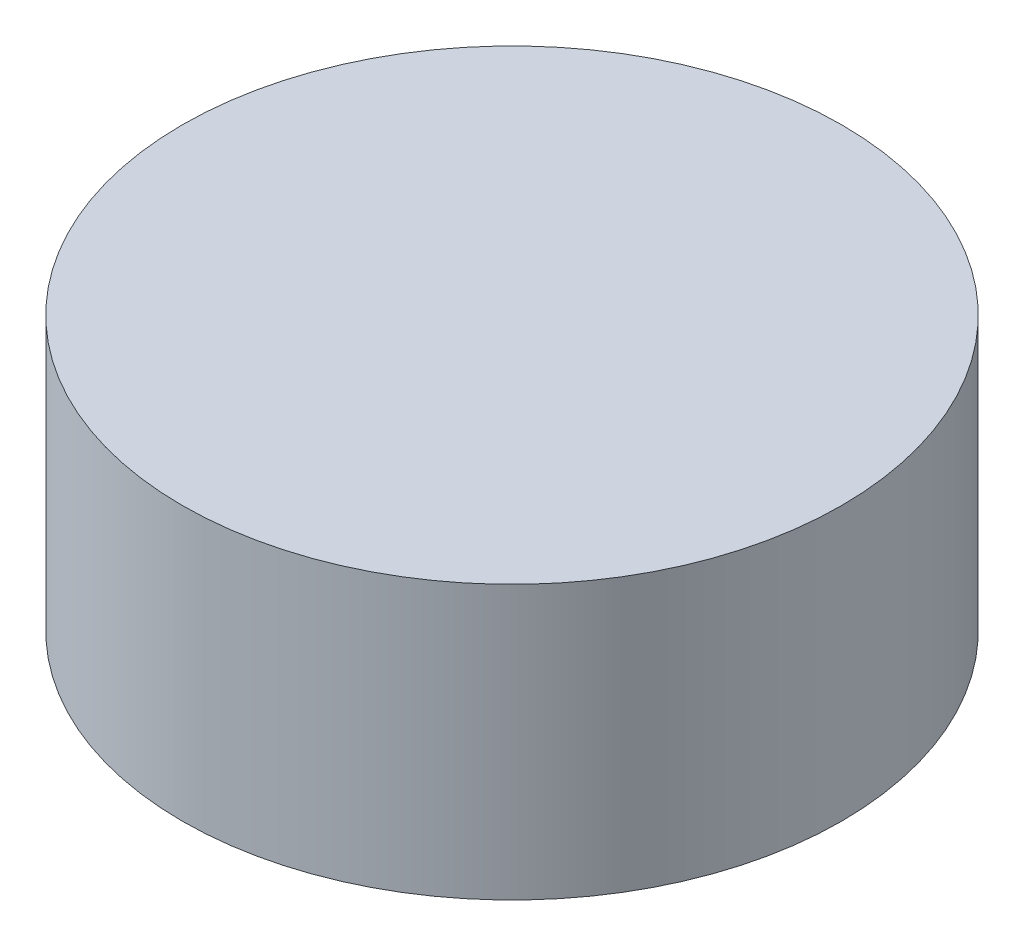
ISO-10303-21;
HEADER;
FILE_DESCRIPTION(('STEP AP214'),'2;1');
FILE_NAME('part.step','',(''),(''),'','','');
FILE_SCHEMA(('AUTOMOTIVE_DESIGN { 1 0 10303 214 1 1 1 1 }'));
ENDSEC;
DATA;
#1=APPLICATION_CONTEXT('core data for automotive mechanical design processes');
#2=APPLICATION_PROTOCOL_DEFINITION('international standard','automotive_design',2000,#1);
#3=PRODUCT_CONTEXT('',#1,'mechanical');
#4=PRODUCT('Part','Part','',(#3));
#5=PRODUCT_RELATED_PRODUCT_CATEGORY('part','',(#4));
#6=PRODUCT_DEFINITION_FORMATION('','',#4);
#7=PRODUCT_DEFINITION_CONTEXT('part definition',#1,'design');
#8=PRODUCT_DEFINITION('design','',#6,#7);
#9=PRODUCT_DEFINITION_SHAPE('','',#8);
#10=(LENGTH_UNIT() NAMED_UNIT(*) SI_UNIT(.MILLI.,.METRE.));
#11=(NAMED_UNIT(*) PLANE_ANGLE_UNIT() SI_UNIT($,.RADIAN.));
#12=(NAMED_UNIT(*) SI_UNIT($,.STERADIAN.) SOLID_ANGLE_UNIT());
#13=UNCERTAINTY_MEASURE_WITH_UNIT(LENGTH_MEASURE(1.E-05),#10,'distance_accuracy_value','');
#14=(GEOMETRIC_REPRESENTATION_CONTEXT(3) GLOBAL_UNCERTAINTY_ASSIGNED_CONTEXT((#13)) GLOBAL_UNIT_ASSIGNED_CONTEXT((#10,
#11,#12)) REPRESENTATION_CONTEXT('',''));
#15=CARTESIAN_POINT('',(0.,0.,0.));
#16=DIRECTION('',(0.,0.,1.));
#17=DIRECTION('',(1.,0.,0.));
#18=AXIS2_PLACEMENT_3D('',#15,#16,#17);
#19=CARTESIAN_POINT('',(0.,17.,0.));
#20=DIRECTION('',(0.,-1.,0.));
#21=DIRECTION('',(0.,0.,-1.));
#22=AXIS2_PLACEMENT_3D('',#19,#20,#21);
#23=CYLINDRICAL_SURFACE('',#22,20.5);
#24=CARTESIAN_POINT('',(0.,17.,0.));
#25=DIRECTION('',(0.,1.,0.));
#26=DIRECTION('',(0.,0.,1.));
#27=AXIS2_PLACEMENT_3D('',#24,#25,#26);
#28=CIRCLE('',#27,20.5);
#29=CARTESIAN_POINT('',(0.,17.,20.5));
#30=VERTEX_POINT('',#29);
#31=EDGE_CURVE('E10',#30,#30,#28,.T.);
#32=ORIENTED_EDGE('',*,*,#31,.F.);
#33=EDGE_LOOP('',(#32));
#34=FACE_BOUND('',#33,.T.);
#35=CARTESIAN_POINT('',(0.,0.,0.));
#36=DIRECTION('',(0.,1.,0.));
#37=DIRECTION('',(0.,0.,1.));
#38=AXIS2_PLACEMENT_3D('',#35,#36,#37);
#39=CIRCLE('',#38,20.5);
#40=CARTESIAN_POINT('',(0.,0.,20.5));
#41=VERTEX_POINT('',#40);
#42=EDGE_CURVE('E34',#41,#41,#39,.T.);
#43=ORIENTED_EDGE('',*,*,#42,.T.);
#44=EDGE_LOOP('',(#43));
#45=FACE_BOUND('',#44,.T.);
#46=ADVANCED_FACE('F31',(#34,#45),#23,.T.);
#47=CARTESIAN_POINT('',(0.,17.,0.));
#48=DIRECTION('',(0.,1.,0.));
#49=DIRECTION('',(0.,0.,1.));
#50=AXIS2_PLACEMENT_3D('',#47,#48,#49);
#51=PLANE('',#50);
#52=ORIENTED_EDGE('',*,*,#31,.T.);
#53=EDGE_LOOP('',(#52));
#54=FACE_BOUND('',#53,.T.);
#55=ADVANCED_FACE('F46',(#54),#51,.T.);
#56=CARTESIAN_POINT('',(0.,0.,0.));
#57=DIRECTION('',(0.,1.,0.));
#58=DIRECTION('',(0.,0.,1.));
#59=AXIS2_PLACEMENT_3D('',#56,#57,#58);
#60=PLANE('',#59);
#61=ORIENTED_EDGE('',*,*,#42,.F.);
#62=EDGE_LOOP('',(#61));
#63=FACE_BOUND('',#62,.T.);
#64=ADVANCED_FACE('F44',(#63),#60,.F.);
#65=CLOSED_SHELL('',(#46,#55,#64));
#66=MANIFOLD_SOLID_BREP('B2',#65);
#67=ADVANCED_BREP_SHAPE_REPRESENTATION('',(#18,#66),#14);
#68=SHAPE_DEFINITION_REPRESENTATION(#9,#67);
ENDSEC;
END-ISO-10303-21;
